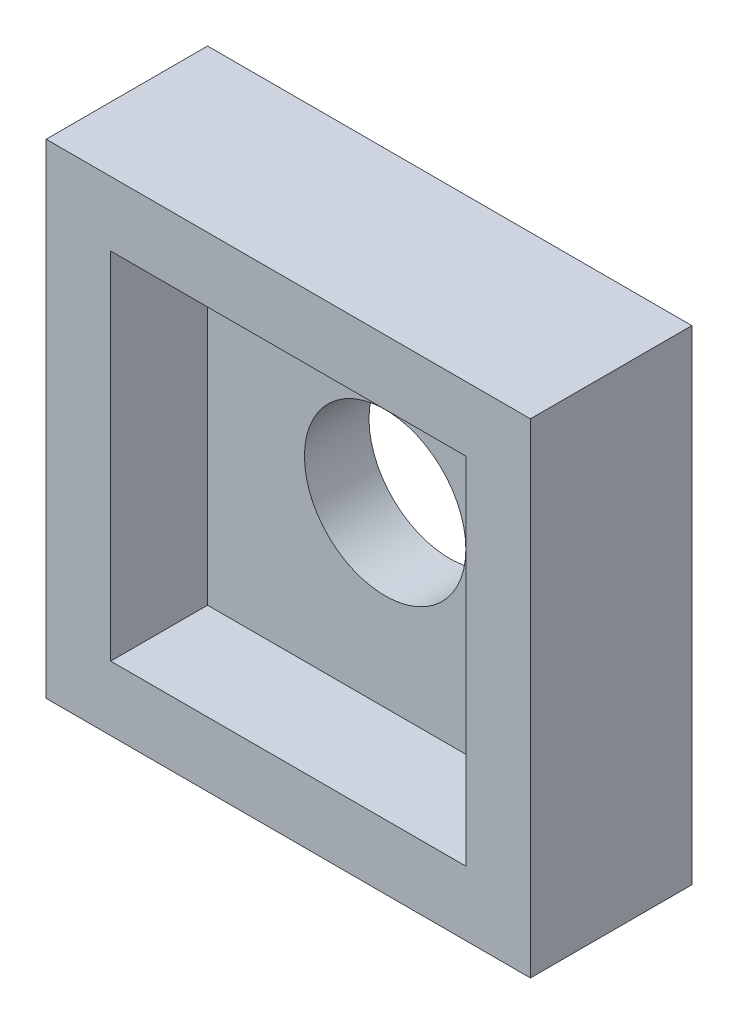
ISO-10303-21;
HEADER;
FILE_DESCRIPTION(('STEP AP214'),'2;1');
FILE_NAME('part.step','',(''),(''),'','','');
FILE_SCHEMA(('AUTOMOTIVE_DESIGN { 1 0 10303 214 1 1 1 1 }'));
ENDSEC;
DATA;
#1=APPLICATION_CONTEXT('core data for automotive mechanical design processes');
#2=APPLICATION_PROTOCOL_DEFINITION('international standard','automotive_design',2000,#1);
#3=PRODUCT_CONTEXT('',#1,'mechanical');
#4=PRODUCT('Part','Part','',(#3));
#5=PRODUCT_RELATED_PRODUCT_CATEGORY('part','',(#4));
#6=PRODUCT_DEFINITION_FORMATION('','',#4);
#7=PRODUCT_DEFINITION_CONTEXT('part definition',#1,'design');
#8=PRODUCT_DEFINITION('design','',#6,#7);
#9=PRODUCT_DEFINITION_SHAPE('','',#8);
#10=(LENGTH_UNIT() NAMED_UNIT(*) SI_UNIT(.MILLI.,.METRE.));
#11=(NAMED_UNIT(*) PLANE_ANGLE_UNIT() SI_UNIT($,.RADIAN.));
#12=(NAMED_UNIT(*) SI_UNIT($,.STERADIAN.) SOLID_ANGLE_UNIT());
#13=UNCERTAINTY_MEASURE_WITH_UNIT(LENGTH_MEASURE(1.E-05),#10,'distance_accuracy_value','');
#14=(GEOMETRIC_REPRESENTATION_CONTEXT(3) GLOBAL_UNCERTAINTY_ASSIGNED_CONTEXT((#13)) GLOBAL_UNIT_ASSIGNED_CONTEXT((#10,
#11,#12)) REPRESENTATION_CONTEXT('',''));
#15=CARTESIAN_POINT('',(0.,0.,0.));
#16=DIRECTION('',(0.,0.,1.));
#17=DIRECTION('',(1.,0.,0.));
#18=AXIS2_PLACEMENT_3D('',#15,#16,#17);
#19=CARTESIAN_POINT('',(0.,0.,5.));
#20=DIRECTION('',(0.,0.,-1.));
#21=DIRECTION('',(-1.,0.,0.));
#22=AXIS2_PLACEMENT_3D('',#19,#20,#21);
#23=PLANE('',#22);
#24=DIRECTION('',(0.,1.,0.));
#25=VECTOR('',#24,1.);
#26=CARTESIAN_POINT('',(7.5,-7.5,5.));
#27=LINE('',#26,#25);
#28=CARTESIAN_POINT('',(7.5,-7.5,5.));
#29=VERTEX_POINT('',#28);
#30=CARTESIAN_POINT('',(7.5,7.5,5.));
#31=VERTEX_POINT('',#30);
#32=EDGE_CURVE('E148',#29,#31,#27,.T.);
#33=ORIENTED_EDGE('',*,*,#32,.T.);
#34=DIRECTION('',(-1.,0.,0.));
#35=VECTOR('',#34,1.);
#36=CARTESIAN_POINT('',(-7.5,7.5,5.));
#37=LINE('',#36,#35);
#38=CARTESIAN_POINT('',(-7.5,7.5,5.));
#39=VERTEX_POINT('',#38);
#40=EDGE_CURVE('E92',#31,#39,#37,.T.);
#41=ORIENTED_EDGE('',*,*,#40,.T.);
#42=DIRECTION('',(0.,-1.,0.));
#43=VECTOR('',#42,1.);
#44=CARTESIAN_POINT('',(-7.5,-7.5,5.));
#45=LINE('',#44,#43);
#46=CARTESIAN_POINT('',(-7.5,-7.5,5.));
#47=VERTEX_POINT('',#46);
#48=EDGE_CURVE('E151',#39,#47,#45,.T.);
#49=ORIENTED_EDGE('',*,*,#48,.T.);
#50=DIRECTION('',(1.,0.,0.));
#51=VECTOR('',#50,1.);
#52=CARTESIAN_POINT('',(-7.5,-7.5,5.));
#53=LINE('',#52,#51);
#54=EDGE_CURVE('E64',#47,#29,#53,.T.);
#55=ORIENTED_EDGE('',*,*,#54,.T.);
#56=EDGE_LOOP('',(#33,#41,#49,#55));
#57=FACE_BOUND('',#56,.T.);
#58=DIRECTION('',(0.,1.,0.));
#59=VECTOR('',#58,1.);
#60=CARTESIAN_POINT('',(5.5,0.,5.));
#61=LINE('',#60,#59);
#62=CARTESIAN_POINT('',(5.5,-5.5,5.));
#63=VERTEX_POINT('',#62);
#64=CARTESIAN_POINT('',(5.5,5.5,5.));
#65=VERTEX_POINT('',#64);
#66=EDGE_CURVE('E137',#63,#65,#61,.T.);
#67=ORIENTED_EDGE('',*,*,#66,.F.);
#68=DIRECTION('',(1.,0.,0.));
#69=VECTOR('',#68,1.);
#70=CARTESIAN_POINT('',(0.,-5.5,5.));
#71=LINE('',#70,#69);
#72=CARTESIAN_POINT('',(-5.5,-5.5,5.));
#73=VERTEX_POINT('',#72);
#74=EDGE_CURVE('E146',#73,#63,#71,.T.);
#75=ORIENTED_EDGE('',*,*,#74,.F.);
#76=DIRECTION('',(0.,-1.,0.));
#77=VECTOR('',#76,1.);
#78=CARTESIAN_POINT('',(-5.5,0.,5.));
#79=LINE('',#78,#77);
#80=CARTESIAN_POINT('',(-5.5,5.5,5.));
#81=VERTEX_POINT('',#80);
#82=EDGE_CURVE('E144',#81,#73,#79,.T.);
#83=ORIENTED_EDGE('',*,*,#82,.F.);
#84=DIRECTION('',(-1.,0.,0.));
#85=VECTOR('',#84,1.);
#86=CARTESIAN_POINT('',(0.,5.5,5.));
#87=LINE('',#86,#85);
#88=EDGE_CURVE('E129',#65,#81,#87,.T.);
#89=ORIENTED_EDGE('',*,*,#88,.F.);
#90=EDGE_LOOP('',(#67,#75,#83,#89));
#91=FACE_BOUND('',#90,.T.);
#92=ADVANCED_FACE('F39',(#57,#91),#23,.F.);
#93=CARTESIAN_POINT('',(7.5,-7.5,5.));
#94=DIRECTION('',(-1.,0.,0.));
#95=DIRECTION('',(0.,0.,1.));
#96=AXIS2_PLACEMENT_3D('',#93,#94,#95);
#97=PLANE('',#96);
#98=DIRECTION('',(0.,1.,0.));
#99=VECTOR('',#98,1.);
#100=CARTESIAN_POINT('',(7.5,-7.5,0.));
#101=LINE('',#100,#99);
#102=CARTESIAN_POINT('',(7.5,-7.5,0.));
#103=VERTEX_POINT('',#102);
#104=CARTESIAN_POINT('',(7.5,7.5,0.));
#105=VERTEX_POINT('',#104);
#106=EDGE_CURVE('E155',#103,#105,#101,.T.);
#107=ORIENTED_EDGE('',*,*,#106,.T.);
#108=DIRECTION('',(0.,0.,-1.));
#109=VECTOR('',#108,1.);
#110=CARTESIAN_POINT('',(7.5,7.5,5.));
#111=LINE('',#110,#109);
#112=EDGE_CURVE('E11',#31,#105,#111,.T.);
#113=ORIENTED_EDGE('',*,*,#112,.F.);
#114=ORIENTED_EDGE('',*,*,#32,.F.);
#115=DIRECTION('',(0.,0.,-1.));
#116=VECTOR('',#115,1.);
#117=CARTESIAN_POINT('',(7.5,-7.5,5.));
#118=LINE('',#117,#116);
#119=EDGE_CURVE('E154',#29,#103,#118,.T.);
#120=ORIENTED_EDGE('',*,*,#119,.T.);
#121=EDGE_LOOP('',(#107,#113,#114,#120));
#122=FACE_BOUND('',#121,.T.);
#123=ADVANCED_FACE('F41',(#122),#97,.F.);
#124=CARTESIAN_POINT('',(-7.5,7.5,5.));
#125=DIRECTION('',(0.,-1.,0.));
#126=DIRECTION('',(0.,0.,-1.));
#127=AXIS2_PLACEMENT_3D('',#124,#125,#126);
#128=PLANE('',#127);
#129=DIRECTION('',(-1.,0.,0.));
#130=VECTOR('',#129,1.);
#131=CARTESIAN_POINT('',(-7.5,7.5,0.));
#132=LINE('',#131,#130);
#133=CARTESIAN_POINT('',(-7.5,7.5,0.));
#134=VERTEX_POINT('',#133);
#135=EDGE_CURVE('E158',#105,#134,#132,.T.);
#136=ORIENTED_EDGE('',*,*,#135,.T.);
#137=DIRECTION('',(0.,0.,-1.));
#138=VECTOR('',#137,1.);
#139=CARTESIAN_POINT('',(-7.5,7.5,5.));
#140=LINE('',#139,#138);
#141=EDGE_CURVE('E48',#39,#134,#140,.T.);
#142=ORIENTED_EDGE('',*,*,#141,.F.);
#143=ORIENTED_EDGE('',*,*,#40,.F.);
#144=ORIENTED_EDGE('',*,*,#112,.T.);
#145=EDGE_LOOP('',(#136,#142,#143,#144));
#146=FACE_BOUND('',#145,.T.);
#147=ADVANCED_FACE('F189',(#146),#128,.F.);
#148=CARTESIAN_POINT('',(-7.5,-7.5,5.));
#149=DIRECTION('',(1.,0.,0.));
#150=DIRECTION('',(0.,0.,-1.));
#151=AXIS2_PLACEMENT_3D('',#148,#149,#150);
#152=PLANE('',#151);
#153=DIRECTION('',(0.,-1.,0.));
#154=VECTOR('',#153,1.);
#155=CARTESIAN_POINT('',(-7.5,-7.5,0.));
#156=LINE('',#155,#154);
#157=CARTESIAN_POINT('',(-7.5,-7.5,0.));
#158=VERTEX_POINT('',#157);
#159=EDGE_CURVE('E160',#134,#158,#156,.T.);
#160=ORIENTED_EDGE('',*,*,#159,.T.);
#161=DIRECTION('',(0.,0.,-1.));
#162=VECTOR('',#161,1.);
#163=CARTESIAN_POINT('',(-7.5,-7.5,5.));
#164=LINE('',#163,#162);
#165=EDGE_CURVE('E164',#47,#158,#164,.T.);
#166=ORIENTED_EDGE('',*,*,#165,.F.);
#167=ORIENTED_EDGE('',*,*,#48,.F.);
#168=ORIENTED_EDGE('',*,*,#141,.T.);
#169=EDGE_LOOP('',(#160,#166,#167,#168));
#170=FACE_BOUND('',#169,.T.);
#171=ADVANCED_FACE('F170',(#170),#152,.F.);
#172=CARTESIAN_POINT('',(-7.5,-7.5,5.));
#173=DIRECTION('',(0.,1.,0.));
#174=DIRECTION('',(0.,0.,1.));
#175=AXIS2_PLACEMENT_3D('',#172,#173,#174);
#176=PLANE('',#175);
#177=DIRECTION('',(1.,0.,0.));
#178=VECTOR('',#177,1.);
#179=CARTESIAN_POINT('',(-7.5,-7.5,0.));
#180=LINE('',#179,#178);
#181=EDGE_CURVE('E85',#158,#103,#180,.T.);
#182=ORIENTED_EDGE('',*,*,#181,.T.);
#183=ORIENTED_EDGE('',*,*,#119,.F.);
#184=ORIENTED_EDGE('',*,*,#54,.F.);
#185=ORIENTED_EDGE('',*,*,#165,.T.);
#186=EDGE_LOOP('',(#182,#183,#184,#185));
#187=FACE_BOUND('',#186,.T.);
#188=ADVANCED_FACE('F178',(#187),#176,.F.);
#189=CARTESIAN_POINT('',(0.,0.,0.));
#190=DIRECTION('',(0.,0.,-1.));
#191=DIRECTION('',(-1.,0.,0.));
#192=AXIS2_PLACEMENT_3D('',#189,#190,#191);
#193=PLANE('',#192);
#194=CARTESIAN_POINT('',(0.,0.,0.));
#195=DIRECTION('',(0.,0.,-1.));
#196=DIRECTION('',(-1.,0.,0.));
#197=AXIS2_PLACEMENT_3D('',#194,#195,#196);
#198=CIRCLE('',#197,2.5);
#199=CARTESIAN_POINT('',(-2.5,0.,0.));
#200=VERTEX_POINT('',#199);
#201=EDGE_CURVE('E220',#200,#200,#198,.T.);
#202=ORIENTED_EDGE('',*,*,#201,.F.);
#203=EDGE_LOOP('',(#202));
#204=FACE_BOUND('',#203,.T.);
#205=ORIENTED_EDGE('',*,*,#106,.F.);
#206=ORIENTED_EDGE('',*,*,#181,.F.);
#207=ORIENTED_EDGE('',*,*,#159,.F.);
#208=ORIENTED_EDGE('',*,*,#135,.F.);
#209=EDGE_LOOP('',(#205,#206,#207,#208));
#210=FACE_BOUND('',#209,.T.);
#211=ADVANCED_FACE('F174',(#204,#210),#193,.T.);
#212=CARTESIAN_POINT('',(5.5,-7.5,5.));
#213=DIRECTION('',(-1.,0.,0.));
#214=DIRECTION('',(0.,0.,1.));
#215=AXIS2_PLACEMENT_3D('',#212,#213,#214);
#216=PLANE('',#215);
#217=DIRECTION('',(0.,1.,0.));
#218=VECTOR('',#217,1.);
#219=CARTESIAN_POINT('',(5.5,0.,2.));
#220=LINE('',#219,#218);
#221=CARTESIAN_POINT('',(5.5,-5.5,2.));
#222=VERTEX_POINT('',#221);
#223=CARTESIAN_POINT('',(5.5,5.5,2.));
#224=VERTEX_POINT('',#223);
#225=EDGE_CURVE('E120',#222,#224,#220,.T.);
#226=ORIENTED_EDGE('',*,*,#225,.F.);
#227=DIRECTION('',(0.,0.,-1.));
#228=VECTOR('',#227,1.);
#229=CARTESIAN_POINT('',(5.5,-5.5,5.));
#230=LINE('',#229,#228);
#231=EDGE_CURVE('E140',#63,#222,#230,.T.);
#232=ORIENTED_EDGE('',*,*,#231,.F.);
#233=ORIENTED_EDGE('',*,*,#66,.T.);
#234=DIRECTION('',(0.,0.,-1.));
#235=VECTOR('',#234,1.);
#236=CARTESIAN_POINT('',(5.5,5.5,5.));
#237=LINE('',#236,#235);
#238=EDGE_CURVE('E132',#65,#224,#237,.T.);
#239=ORIENTED_EDGE('',*,*,#238,.T.);
#240=EDGE_LOOP('',(#226,#232,#233,#239));
#241=FACE_BOUND('',#240,.T.);
#242=ADVANCED_FACE('F186',(#241),#216,.T.);
#243=CARTESIAN_POINT('',(-7.5,5.5,5.));
#244=DIRECTION('',(0.,-1.,0.));
#245=DIRECTION('',(0.,0.,-1.));
#246=AXIS2_PLACEMENT_3D('',#243,#244,#245);
#247=PLANE('',#246);
#248=DIRECTION('',(-1.,0.,0.));
#249=VECTOR('',#248,1.);
#250=CARTESIAN_POINT('',(0.,5.5,2.));
#251=LINE('',#250,#249);
#252=CARTESIAN_POINT('',(-5.5,5.5,2.));
#253=VERTEX_POINT('',#252);
#254=EDGE_CURVE('E114',#224,#253,#251,.T.);
#255=ORIENTED_EDGE('',*,*,#254,.F.);
#256=ORIENTED_EDGE('',*,*,#238,.F.);
#257=ORIENTED_EDGE('',*,*,#88,.T.);
#258=DIRECTION('',(0.,0.,-1.));
#259=VECTOR('',#258,1.);
#260=CARTESIAN_POINT('',(-5.5,5.5,5.));
#261=LINE('',#260,#259);
#262=EDGE_CURVE('E126',#81,#253,#261,.T.);
#263=ORIENTED_EDGE('',*,*,#262,.T.);
#264=EDGE_LOOP('',(#255,#256,#257,#263));
#265=FACE_BOUND('',#264,.T.);
#266=ADVANCED_FACE('F127',(#265),#247,.T.);
#267=CARTESIAN_POINT('',(-5.5,-7.5,5.));
#268=DIRECTION('',(1.,0.,0.));
#269=DIRECTION('',(0.,0.,-1.));
#270=AXIS2_PLACEMENT_3D('',#267,#268,#269);
#271=PLANE('',#270);
#272=DIRECTION('',(0.,-1.,0.));
#273=VECTOR('',#272,1.);
#274=CARTESIAN_POINT('',(-5.5,0.,2.));
#275=LINE('',#274,#273);
#276=CARTESIAN_POINT('',(-5.5,-5.5,2.));
#277=VERTEX_POINT('',#276);
#278=EDGE_CURVE('E118',#253,#277,#275,.T.);
#279=ORIENTED_EDGE('',*,*,#278,.F.);
#280=ORIENTED_EDGE('',*,*,#262,.F.);
#281=ORIENTED_EDGE('',*,*,#82,.T.);
#282=DIRECTION('',(0.,0.,-1.));
#283=VECTOR('',#282,1.);
#284=CARTESIAN_POINT('',(-5.5,-5.5,5.));
#285=LINE('',#284,#283);
#286=EDGE_CURVE('E55',#73,#277,#285,.T.);
#287=ORIENTED_EDGE('',*,*,#286,.T.);
#288=EDGE_LOOP('',(#279,#280,#281,#287));
#289=FACE_BOUND('',#288,.T.);
#290=ADVANCED_FACE('F134',(#289),#271,.T.);
#291=CARTESIAN_POINT('',(-7.5,-5.5,5.));
#292=DIRECTION('',(0.,1.,0.));
#293=DIRECTION('',(0.,0.,1.));
#294=AXIS2_PLACEMENT_3D('',#291,#292,#293);
#295=PLANE('',#294);
#296=DIRECTION('',(1.,0.,0.));
#297=VECTOR('',#296,1.);
#298=CARTESIAN_POINT('',(0.,-5.5,2.));
#299=LINE('',#298,#297);
#300=EDGE_CURVE('E135',#277,#222,#299,.T.);
#301=ORIENTED_EDGE('',*,*,#300,.F.);
#302=ORIENTED_EDGE('',*,*,#286,.F.);
#303=ORIENTED_EDGE('',*,*,#74,.T.);
#304=ORIENTED_EDGE('',*,*,#231,.T.);
#305=EDGE_LOOP('',(#301,#302,#303,#304));
#306=FACE_BOUND('',#305,.T.);
#307=ADVANCED_FACE('F201',(#306),#295,.T.);
#308=CARTESIAN_POINT('',(0.,0.,2.));
#309=DIRECTION('',(0.,0.,-1.));
#310=DIRECTION('',(-1.,0.,0.));
#311=AXIS2_PLACEMENT_3D('',#308,#309,#310);
#312=PLANE('',#311);
#313=CARTESIAN_POINT('',(0.,0.,2.));
#314=DIRECTION('',(0.,0.,-1.));
#315=DIRECTION('',(-1.,0.,0.));
#316=AXIS2_PLACEMENT_3D('',#313,#314,#315);
#317=CIRCLE('',#316,2.5);
#318=CARTESIAN_POINT('',(-2.5,0.,2.));
#319=VERTEX_POINT('',#318);
#320=EDGE_CURVE('E43',#319,#319,#317,.T.);
#321=ORIENTED_EDGE('',*,*,#320,.T.);
#322=EDGE_LOOP('',(#321));
#323=FACE_BOUND('',#322,.T.);
#324=ORIENTED_EDGE('',*,*,#225,.T.);
#325=ORIENTED_EDGE('',*,*,#254,.T.);
#326=ORIENTED_EDGE('',*,*,#278,.T.);
#327=ORIENTED_EDGE('',*,*,#300,.T.);
#328=EDGE_LOOP('',(#324,#325,#326,#327));
#329=FACE_BOUND('',#328,.T.);
#330=ADVANCED_FACE('F116',(#323,#329),#312,.F.);
#331=CARTESIAN_POINT('',(0.,0.,5.));
#332=DIRECTION('',(0.,0.,-1.));
#333=DIRECTION('',(-1.,0.,0.));
#334=AXIS2_PLACEMENT_3D('',#331,#332,#333);
#335=CYLINDRICAL_SURFACE('',#334,2.5);
#336=ORIENTED_EDGE('',*,*,#201,.T.);
#337=EDGE_LOOP('',(#336));
#338=FACE_BOUND('',#337,.T.);
#339=ORIENTED_EDGE('',*,*,#320,.F.);
#340=EDGE_LOOP('',(#339));
#341=FACE_BOUND('',#340,.T.);
#342=ADVANCED_FACE('F200',(#338,#341),#335,.F.);
#343=CLOSED_SHELL('',(#92,#123,#147,#171,#188,#211,#242,#266,#290,#307,#330,#342));
#344=MANIFOLD_SOLID_BREP('B2',#343);
#345=ADVANCED_BREP_SHAPE_REPRESENTATION('',(#18,#344),#14);
#346=SHAPE_DEFINITION_REPRESENTATION(#9,#345);
ENDSEC;
END-ISO-10303-21;
